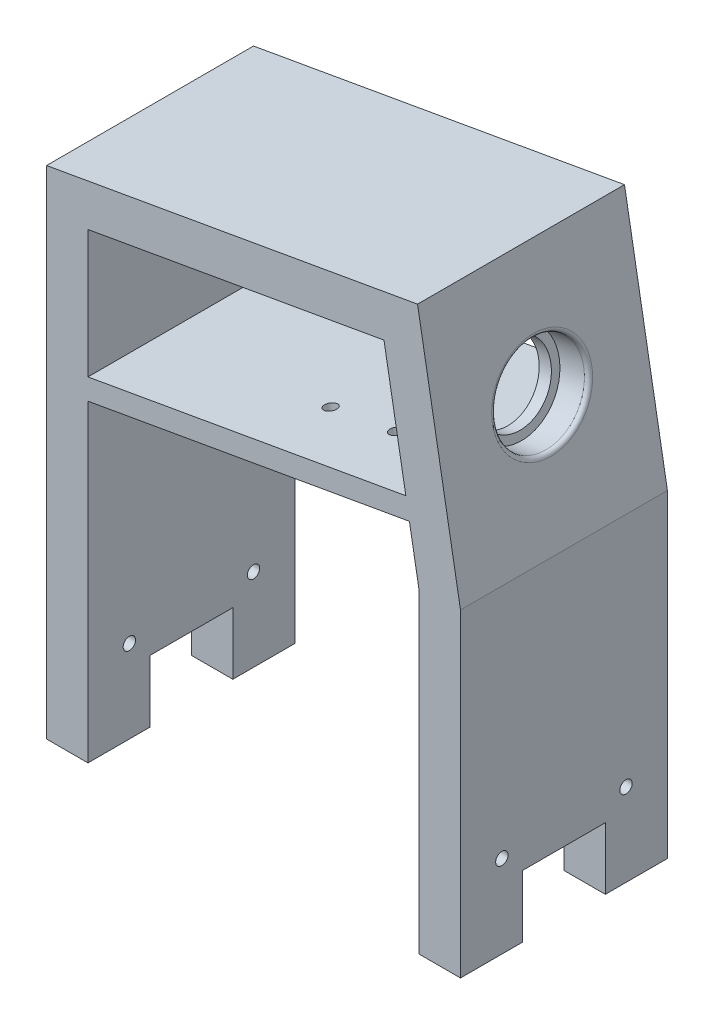
ISO-10303-21;
HEADER;
FILE_DESCRIPTION(('STEP AP214'),'2;1');
FILE_NAME('part.step','',(''),(''),'','','');
FILE_SCHEMA(('AUTOMOTIVE_DESIGN { 1 0 10303 214 1 1 1 1 }'));
ENDSEC;
DATA;
#1=APPLICATION_CONTEXT('core data for automotive mechanical design processes');
#2=APPLICATION_PROTOCOL_DEFINITION('international standard','automotive_design',2000,#1);
#3=PRODUCT_CONTEXT('',#1,'mechanical');
#4=PRODUCT('Part','Part','',(#3));
#5=PRODUCT_RELATED_PRODUCT_CATEGORY('part','',(#4));
#6=PRODUCT_DEFINITION_FORMATION('','',#4);
#7=PRODUCT_DEFINITION_CONTEXT('part definition',#1,'design');
#8=PRODUCT_DEFINITION('design','',#6,#7);
#9=PRODUCT_DEFINITION_SHAPE('','',#8);
#10=(LENGTH_UNIT() NAMED_UNIT(*) SI_UNIT(.MILLI.,.METRE.));
#11=(NAMED_UNIT(*) PLANE_ANGLE_UNIT() SI_UNIT($,.RADIAN.));
#12=(NAMED_UNIT(*) SI_UNIT($,.STERADIAN.) SOLID_ANGLE_UNIT());
#13=UNCERTAINTY_MEASURE_WITH_UNIT(LENGTH_MEASURE(1.E-05),#10,'distance_accuracy_value','');
#14=(GEOMETRIC_REPRESENTATION_CONTEXT(3) GLOBAL_UNCERTAINTY_ASSIGNED_CONTEXT((#13)) GLOBAL_UNIT_ASSIGNED_CONTEXT((#10,
#11,#12)) REPRESENTATION_CONTEXT('',''));
#15=CARTESIAN_POINT('',(0.,0.,0.));
#16=DIRECTION('',(0.,0.,1.));
#17=DIRECTION('',(1.,0.,0.));
#18=AXIS2_PLACEMENT_3D('',#15,#16,#17);
#19=CARTESIAN_POINT('',(50.0100000000001,105.,35.));
#20=DIRECTION('',(0.,-1.,0.));
#21=DIRECTION('',(1.,0.,0.));
#22=AXIS2_PLACEMENT_3D('',#19,#20,#21);
#23=PLANE('',#22);
#24=DIRECTION('',(0.,0.,-1.));
#25=VECTOR('',#24,1.);
#26=CARTESIAN_POINT('',(-40.,105.,50.));
#27=LINE('',#26,#25);
#28=CARTESIAN_POINT('',(-40.,105.,50.));
#29=VERTEX_POINT('',#28);
#30=CARTESIAN_POINT('',(-40.,105.,35.));
#31=VERTEX_POINT('',#30);
#32=EDGE_CURVE('E380',#29,#31,#27,.T.);
#33=ORIENTED_EDGE('',*,*,#32,.F.);
#34=DIRECTION('',(1.,0.,0.));
#35=VECTOR('',#34,1.);
#36=CARTESIAN_POINT('',(0.,105.,50.));
#37=LINE('',#36,#35);
#38=CARTESIAN_POINT('',(-50.,105.,50.));
#39=VERTEX_POINT('',#38);
#40=EDGE_CURVE('E366',#39,#29,#37,.T.);
#41=ORIENTED_EDGE('',*,*,#40,.F.);
#42=DIRECTION('',(0.,0.,-1.));
#43=VECTOR('',#42,1.);
#44=CARTESIAN_POINT('',(-50.,105.,50.));
#45=LINE('',#44,#43);
#46=CARTESIAN_POINT('',(-50.,105.,35.));
#47=VERTEX_POINT('',#46);
#48=EDGE_CURVE('E222',#39,#47,#45,.T.);
#49=ORIENTED_EDGE('',*,*,#48,.T.);
#50=DIRECTION('',(-1.,0.,0.));
#51=VECTOR('',#50,1.);
#52=CARTESIAN_POINT('',(50.0100000000001,105.,35.));
#53=LINE('',#52,#51);
#54=EDGE_CURVE('E11',#31,#47,#53,.T.);
#55=ORIENTED_EDGE('',*,*,#54,.F.);
#56=EDGE_LOOP('',(#33,#41,#49,#55));
#57=FACE_BOUND('',#56,.T.);
#58=ADVANCED_FACE('F41',(#57),#23,.T.);
#59=CARTESIAN_POINT('',(50.0100000000001,120.,35.));
#60=DIRECTION('',(0.,0.,-1.));
#61=DIRECTION('',(-1.,0.,0.));
#62=AXIS2_PLACEMENT_3D('',#59,#60,#61);
#63=PLANE('',#62);
#64=DIRECTION('',(0.,1.,0.));
#65=VECTOR('',#64,1.);
#66=CARTESIAN_POINT('',(-40.,216.619003688227,35.));
#67=LINE('',#66,#65);
#68=CARTESIAN_POINT('',(-40.,120.,35.));
#69=VERTEX_POINT('',#68);
#70=EDGE_CURVE('E383',#31,#69,#67,.T.);
#71=ORIENTED_EDGE('',*,*,#70,.F.);
#72=ORIENTED_EDGE('',*,*,#54,.T.);
#73=DIRECTION('',(0.,1.,0.));
#74=VECTOR('',#73,1.);
#75=CARTESIAN_POINT('',(-50.,225.01,35.));
#76=LINE('',#75,#74);
#77=CARTESIAN_POINT('',(-50.,120.,35.));
#78=VERTEX_POINT('',#77);
#79=EDGE_CURVE('E225',#47,#78,#76,.T.);
#80=ORIENTED_EDGE('',*,*,#79,.T.);
#81=DIRECTION('',(-1.,0.,0.));
#82=VECTOR('',#81,1.);
#83=CARTESIAN_POINT('',(50.0100000000001,120.,35.));
#84=LINE('',#83,#82);
#85=EDGE_CURVE('E354',#69,#78,#84,.T.);
#86=ORIENTED_EDGE('',*,*,#85,.F.);
#87=EDGE_LOOP('',(#71,#72,#80,#86));
#88=FACE_BOUND('',#87,.T.);
#89=ADVANCED_FACE('F407',(#88),#63,.T.);
#90=CARTESIAN_POINT('',(50.0100000000001,120.,15.));
#91=DIRECTION('',(0.,-1.,0.));
#92=DIRECTION('',(1.,0.,0.));
#93=AXIS2_PLACEMENT_3D('',#90,#91,#92);
#94=PLANE('',#93);
#95=DIRECTION('',(0.,0.,-1.));
#96=VECTOR('',#95,1.);
#97=CARTESIAN_POINT('',(-40.,120.,50.));
#98=LINE('',#97,#96);
#99=CARTESIAN_POINT('',(-40.,120.,15.));
#100=VERTEX_POINT('',#99);
#101=EDGE_CURVE('E386',#69,#100,#98,.T.);
#102=ORIENTED_EDGE('',*,*,#101,.F.);
#103=ORIENTED_EDGE('',*,*,#85,.T.);
#104=DIRECTION('',(0.,0.,-1.));
#105=VECTOR('',#104,1.);
#106=CARTESIAN_POINT('',(-50.,120.,50.));
#107=LINE('',#106,#105);
#108=CARTESIAN_POINT('',(-50.,120.,15.));
#109=VERTEX_POINT('',#108);
#110=EDGE_CURVE('E400',#78,#109,#107,.T.);
#111=ORIENTED_EDGE('',*,*,#110,.T.);
#112=DIRECTION('',(-1.,0.,0.));
#113=VECTOR('',#112,1.);
#114=CARTESIAN_POINT('',(50.0100000000001,120.,15.));
#115=LINE('',#114,#113);
#116=EDGE_CURVE('E357',#100,#109,#115,.T.);
#117=ORIENTED_EDGE('',*,*,#116,.F.);
#118=EDGE_LOOP('',(#102,#103,#111,#117));
#119=FACE_BOUND('',#118,.T.);
#120=ADVANCED_FACE('F414',(#119),#94,.T.);
#121=CARTESIAN_POINT('',(50.0100000000001,105.,15.));
#122=DIRECTION('',(0.,0.,1.));
#123=DIRECTION('',(1.,0.,0.));
#124=AXIS2_PLACEMENT_3D('',#121,#122,#123);
#125=PLANE('',#124);
#126=DIRECTION('',(0.,-1.,0.));
#127=VECTOR('',#126,1.);
#128=CARTESIAN_POINT('',(-40.,216.619003688227,15.));
#129=LINE('',#128,#127);
#130=CARTESIAN_POINT('',(-40.,105.,15.));
#131=VERTEX_POINT('',#130);
#132=EDGE_CURVE('E389',#100,#131,#129,.T.);
#133=ORIENTED_EDGE('',*,*,#132,.F.);
#134=ORIENTED_EDGE('',*,*,#116,.T.);
#135=DIRECTION('',(0.,-1.,0.));
#136=VECTOR('',#135,1.);
#137=CARTESIAN_POINT('',(-50.,225.01,15.));
#138=LINE('',#137,#136);
#139=CARTESIAN_POINT('',(-50.,105.,15.));
#140=VERTEX_POINT('',#139);
#141=EDGE_CURVE('E397',#109,#140,#138,.T.);
#142=ORIENTED_EDGE('',*,*,#141,.T.);
#143=DIRECTION('',(-1.,0.,0.));
#144=VECTOR('',#143,1.);
#145=CARTESIAN_POINT('',(50.0100000000001,105.,15.));
#146=LINE('',#145,#144);
#147=EDGE_CURVE('E360',#131,#140,#146,.T.);
#148=ORIENTED_EDGE('',*,*,#147,.F.);
#149=EDGE_LOOP('',(#133,#134,#142,#148));
#150=FACE_BOUND('',#149,.T.);
#151=ADVANCED_FACE('F420',(#150),#125,.T.);
#152=CARTESIAN_POINT('',(50.0100000000001,105.,0.));
#153=DIRECTION('',(0.,-1.,0.));
#154=DIRECTION('',(1.,0.,0.));
#155=AXIS2_PLACEMENT_3D('',#152,#153,#154);
#156=PLANE('',#155);
#157=DIRECTION('',(0.,0.,-1.));
#158=VECTOR('',#157,1.);
#159=CARTESIAN_POINT('',(-40.,105.,50.));
#160=LINE('',#159,#158);
#161=CARTESIAN_POINT('',(-40.,105.,0.));
#162=VERTEX_POINT('',#161);
#163=EDGE_CURVE('E392',#131,#162,#160,.T.);
#164=ORIENTED_EDGE('',*,*,#163,.F.);
#165=ORIENTED_EDGE('',*,*,#147,.T.);
#166=DIRECTION('',(0.,0.,-1.));
#167=VECTOR('',#166,1.);
#168=CARTESIAN_POINT('',(-50.,105.,50.));
#169=LINE('',#168,#167);
#170=CARTESIAN_POINT('',(-50.,105.,0.));
#171=VERTEX_POINT('',#170);
#172=EDGE_CURVE('E215',#140,#171,#169,.T.);
#173=ORIENTED_EDGE('',*,*,#172,.T.);
#174=DIRECTION('',(1.,0.,0.));
#175=VECTOR('',#174,1.);
#176=CARTESIAN_POINT('',(0.,105.,0.));
#177=LINE('',#176,#175);
#178=EDGE_CURVE('E214',#171,#162,#177,.T.);
#179=ORIENTED_EDGE('',*,*,#178,.T.);
#180=EDGE_LOOP('',(#164,#165,#173,#179));
#181=FACE_BOUND('',#180,.T.);
#182=ADVANCED_FACE('F422',(#181),#156,.T.);
#183=DIRECTION('',(0.,0.,1.));
#184=VECTOR('',#183,1.);
#185=CARTESIAN_POINT('',(40.,105.,50.));
#186=LINE('',#185,#184);
#187=CARTESIAN_POINT('',(40.,105.,35.));
#188=VERTEX_POINT('',#187);
#189=CARTESIAN_POINT('',(40.,105.,50.));
#190=VERTEX_POINT('',#189);
#191=EDGE_CURVE('E367',#188,#190,#186,.T.);
#192=ORIENTED_EDGE('',*,*,#191,.F.);
#193=CARTESIAN_POINT('',(50.,105.,35.));
#194=VERTEX_POINT('',#193);
#195=EDGE_CURVE('E50',#194,#188,#53,.T.);
#196=ORIENTED_EDGE('',*,*,#195,.F.);
#197=DIRECTION('',(0.,0.,1.));
#198=VECTOR('',#197,1.);
#199=CARTESIAN_POINT('',(50.,105.,50.));
#200=LINE('',#199,#198);
#201=CARTESIAN_POINT('',(50.,105.,50.));
#202=VERTEX_POINT('',#201);
#203=EDGE_CURVE('E236',#194,#202,#200,.T.);
#204=ORIENTED_EDGE('',*,*,#203,.T.);
#205=EDGE_CURVE('E362',#190,#202,#37,.T.);
#206=ORIENTED_EDGE('',*,*,#205,.F.);
#207=EDGE_LOOP('',(#192,#196,#204,#206));
#208=FACE_BOUND('',#207,.T.);
#209=ADVANCED_FACE('F442',(#208),#23,.T.);
#210=DIRECTION('',(0.,-1.,0.));
#211=VECTOR('',#210,1.);
#212=CARTESIAN_POINT('',(40.,10.,35.));
#213=LINE('',#212,#211);
#214=CARTESIAN_POINT('',(40.,120.,35.));
#215=VERTEX_POINT('',#214);
#216=EDGE_CURVE('E370',#215,#188,#213,.T.);
#217=ORIENTED_EDGE('',*,*,#216,.F.);
#218=CARTESIAN_POINT('',(50.,120.,35.));
#219=VERTEX_POINT('',#218);
#220=EDGE_CURVE('E356',#219,#215,#84,.T.);
#221=ORIENTED_EDGE('',*,*,#220,.F.);
#222=DIRECTION('',(0.,-1.,0.));
#223=VECTOR('',#222,1.);
#224=CARTESIAN_POINT('',(50.,0.,35.));
#225=LINE('',#224,#223);
#226=EDGE_CURVE('E233',#219,#194,#225,.T.);
#227=ORIENTED_EDGE('',*,*,#226,.T.);
#228=ORIENTED_EDGE('',*,*,#195,.T.);
#229=EDGE_LOOP('',(#217,#221,#227,#228));
#230=FACE_BOUND('',#229,.T.);
#231=ADVANCED_FACE('F446',(#230),#63,.T.);
#232=DIRECTION('',(0.,0.,1.));
#233=VECTOR('',#232,1.);
#234=CARTESIAN_POINT('',(40.,120.,50.));
#235=LINE('',#234,#233);
#236=CARTESIAN_POINT('',(40.,120.,15.));
#237=VERTEX_POINT('',#236);
#238=EDGE_CURVE('E373',#237,#215,#235,.T.);
#239=ORIENTED_EDGE('',*,*,#238,.F.);
#240=CARTESIAN_POINT('',(50.,120.,15.));
#241=VERTEX_POINT('',#240);
#242=EDGE_CURVE('E359',#241,#237,#115,.T.);
#243=ORIENTED_EDGE('',*,*,#242,.F.);
#244=DIRECTION('',(0.,0.,1.));
#245=VECTOR('',#244,1.);
#246=CARTESIAN_POINT('',(50.,120.,50.));
#247=LINE('',#246,#245);
#248=EDGE_CURVE('E227',#241,#219,#247,.T.);
#249=ORIENTED_EDGE('',*,*,#248,.T.);
#250=ORIENTED_EDGE('',*,*,#220,.T.);
#251=EDGE_LOOP('',(#239,#243,#249,#250));
#252=FACE_BOUND('',#251,.T.);
#253=ADVANCED_FACE('F449',(#252),#94,.T.);
#254=DIRECTION('',(0.,1.,0.));
#255=VECTOR('',#254,1.);
#256=CARTESIAN_POINT('',(40.,10.,15.));
#257=LINE('',#256,#255);
#258=CARTESIAN_POINT('',(40.,105.,15.));
#259=VERTEX_POINT('',#258);
#260=EDGE_CURVE('E376',#259,#237,#257,.T.);
#261=ORIENTED_EDGE('',*,*,#260,.F.);
#262=CARTESIAN_POINT('',(50.,105.,15.));
#263=VERTEX_POINT('',#262);
#264=EDGE_CURVE('E351',#263,#259,#146,.T.);
#265=ORIENTED_EDGE('',*,*,#264,.F.);
#266=DIRECTION('',(0.,1.,0.));
#267=VECTOR('',#266,1.);
#268=CARTESIAN_POINT('',(50.,0.,15.));
#269=LINE('',#268,#267);
#270=EDGE_CURVE('E221',#263,#241,#269,.T.);
#271=ORIENTED_EDGE('',*,*,#270,.T.);
#272=ORIENTED_EDGE('',*,*,#242,.T.);
#273=EDGE_LOOP('',(#261,#265,#271,#272));
#274=FACE_BOUND('',#273,.T.);
#275=ADVANCED_FACE('F452',(#274),#125,.T.);
#276=DIRECTION('',(0.,0.,1.));
#277=VECTOR('',#276,1.);
#278=CARTESIAN_POINT('',(40.,105.,50.));
#279=LINE('',#278,#277);
#280=CARTESIAN_POINT('',(40.,105.,0.));
#281=VERTEX_POINT('',#280);
#282=EDGE_CURVE('E213',#281,#259,#279,.T.);
#283=ORIENTED_EDGE('',*,*,#282,.F.);
#284=CARTESIAN_POINT('',(50.,105.,0.));
#285=VERTEX_POINT('',#284);
#286=EDGE_CURVE('E197',#281,#285,#177,.T.);
#287=ORIENTED_EDGE('',*,*,#286,.T.);
#288=DIRECTION('',(0.,0.,1.));
#289=VECTOR('',#288,1.);
#290=CARTESIAN_POINT('',(50.,105.,50.));
#291=LINE('',#290,#289);
#292=EDGE_CURVE('E211',#285,#263,#291,.T.);
#293=ORIENTED_EDGE('',*,*,#292,.T.);
#294=ORIENTED_EDGE('',*,*,#264,.T.);
#295=EDGE_LOOP('',(#283,#287,#293,#294));
#296=FACE_BOUND('',#295,.T.);
#297=ADVANCED_FACE('F210',(#296),#156,.T.);
#298=CARTESIAN_POINT('',(-40.,216.619003688227,50.));
#299=DIRECTION('',(1.,0.,0.));
#300=DIRECTION('',(0.,1.,0.));
#301=AXIS2_PLACEMENT_3D('',#298,#299,#300);
#302=PLANE('',#301);
#303=CARTESIAN_POINT('',(-40.,125.,40.));
#304=DIRECTION('',(1.,0.,0.));
#305=DIRECTION('',(0.,1.,0.));
#306=AXIS2_PLACEMENT_3D('',#303,#304,#305);
#307=CIRCLE('',#306,1.5);
#308=CARTESIAN_POINT('',(-40.,126.5,40.));
#309=VERTEX_POINT('',#308);
#310=EDGE_CURVE('E335',#309,#309,#307,.T.);
#311=ORIENTED_EDGE('',*,*,#310,.F.);
#312=EDGE_LOOP('',(#311));
#313=FACE_BOUND('',#312,.T.);
#314=CARTESIAN_POINT('',(-40.,125.,9.99999999999998));
#315=DIRECTION('',(1.,0.,0.));
#316=DIRECTION('',(0.,1.,0.));
#317=AXIS2_PLACEMENT_3D('',#314,#315,#316);
#318=CIRCLE('',#317,1.5);
#319=CARTESIAN_POINT('',(-40.,126.5,9.99999999999998));
#320=VERTEX_POINT('',#319);
#321=EDGE_CURVE('E319',#320,#320,#318,.T.);
#322=ORIENTED_EDGE('',*,*,#321,.F.);
#323=EDGE_LOOP('',(#322));
#324=FACE_BOUND('',#323,.T.);
#325=ORIENTED_EDGE('',*,*,#132,.T.);
#326=ORIENTED_EDGE('',*,*,#163,.T.);
#327=DIRECTION('',(0.,-1.,0.));
#328=VECTOR('',#327,1.);
#329=CARTESIAN_POINT('',(-40.,216.619003688227,0.));
#330=LINE('',#329,#328);
#331=CARTESIAN_POINT('',(-40.,180.69321015971,0.));
#332=VERTEX_POINT('',#331);
#333=EDGE_CURVE('E255',#332,#162,#330,.T.);
#334=ORIENTED_EDGE('',*,*,#333,.F.);
#335=DIRECTION('',(0.,0.,1.));
#336=VECTOR('',#335,1.);
#337=CARTESIAN_POINT('',(-40.,180.69321015971,0.));
#338=LINE('',#337,#336);
#339=CARTESIAN_POINT('',(-40.,180.69321015971,50.));
#340=VERTEX_POINT('',#339);
#341=EDGE_CURVE('E284',#332,#340,#338,.T.);
#342=ORIENTED_EDGE('',*,*,#341,.T.);
#343=DIRECTION('',(0.,-1.,0.));
#344=VECTOR('',#343,1.);
#345=CARTESIAN_POINT('',(-40.,216.619003688227,50.));
#346=LINE('',#345,#344);
#347=EDGE_CURVE('E58',#340,#29,#346,.T.);
#348=ORIENTED_EDGE('',*,*,#347,.T.);
#349=ORIENTED_EDGE('',*,*,#32,.T.);
#350=ORIENTED_EDGE('',*,*,#70,.T.);
#351=ORIENTED_EDGE('',*,*,#101,.T.);
#352=EDGE_LOOP('',(#325,#326,#334,#342,#348,#349,#350,#351));
#353=FACE_BOUND('',#352,.T.);
#354=ADVANCED_FACE('F417',(#313,#324,#353),#302,.T.);
#355=CARTESIAN_POINT('',(40.,10.,50.));
#356=DIRECTION('',(-1.,0.,0.));
#357=DIRECTION('',(0.,0.,1.));
#358=AXIS2_PLACEMENT_3D('',#355,#356,#357);
#359=PLANE('',#358);
#360=CARTESIAN_POINT('',(40.,125.,40.));
#361=DIRECTION('',(-1.,0.,0.));
#362=DIRECTION('',(0.,0.,1.));
#363=AXIS2_PLACEMENT_3D('',#360,#361,#362);
#364=CIRCLE('',#363,1.5);
#365=CARTESIAN_POINT('',(40.,125.,41.5));
#366=VERTEX_POINT('',#365);
#367=EDGE_CURVE('E338',#366,#366,#364,.T.);
#368=ORIENTED_EDGE('',*,*,#367,.F.);
#369=EDGE_LOOP('',(#368));
#370=FACE_BOUND('',#369,.T.);
#371=CARTESIAN_POINT('',(40.,125.,9.99999999999998));
#372=DIRECTION('',(-1.,0.,0.));
#373=DIRECTION('',(0.,0.,1.));
#374=AXIS2_PLACEMENT_3D('',#371,#372,#373);
#375=CIRCLE('',#374,1.5);
#376=CARTESIAN_POINT('',(40.,125.,11.5));
#377=VERTEX_POINT('',#376);
#378=EDGE_CURVE('E332',#377,#377,#375,.T.);
#379=ORIENTED_EDGE('',*,*,#378,.F.);
#380=EDGE_LOOP('',(#379));
#381=FACE_BOUND('',#380,.T.);
#382=DIRECTION('',(0.,1.,0.));
#383=VECTOR('',#382,1.);
#384=CARTESIAN_POINT('',(40.,10.,0.));
#385=LINE('',#384,#383);
#386=CARTESIAN_POINT('',(40.,181.135113364741,0.));
#387=VERTEX_POINT('',#386);
#388=EDGE_CURVE('E250',#281,#387,#385,.T.);
#389=ORIENTED_EDGE('',*,*,#388,.F.);
#390=ORIENTED_EDGE('',*,*,#282,.T.);
#391=ORIENTED_EDGE('',*,*,#260,.T.);
#392=ORIENTED_EDGE('',*,*,#238,.T.);
#393=ORIENTED_EDGE('',*,*,#216,.T.);
#394=ORIENTED_EDGE('',*,*,#191,.T.);
#395=DIRECTION('',(0.,1.,0.));
#396=VECTOR('',#395,1.);
#397=CARTESIAN_POINT('',(40.,10.,50.));
#398=LINE('',#397,#396);
#399=CARTESIAN_POINT('',(40.,181.135113364741,50.));
#400=VERTEX_POINT('',#399);
#401=EDGE_CURVE('E247',#190,#400,#398,.T.);
#402=ORIENTED_EDGE('',*,*,#401,.T.);
#403=DIRECTION('',(0.,0.,-1.));
#404=VECTOR('',#403,1.);
#405=CARTESIAN_POINT('',(40.,181.135113364741,50.));
#406=LINE('',#405,#404);
#407=EDGE_CURVE('E433',#400,#387,#406,.T.);
#408=ORIENTED_EDGE('',*,*,#407,.T.);
#409=EDGE_LOOP('',(#389,#390,#391,#392,#393,#394,#402,#408));
#410=FACE_BOUND('',#409,.T.);
#411=ADVANCED_FACE('F438',(#370,#381,#410),#359,.T.);
#412=CARTESIAN_POINT('',(0.,0.,50.));
#413=DIRECTION('',(0.,0.,1.));
#414=DIRECTION('',(1.,0.,0.));
#415=AXIS2_PLACEMENT_3D('',#412,#413,#414);
#416=PLANE('',#415);
#417=CARTESIAN_POINT('',(-40.,216.619003688227,50.));
#418=VERTEX_POINT('',#417);
#419=CARTESIAN_POINT('',(-40.,185.770343219138,50.));
#420=VERTEX_POINT('',#419);
#421=EDGE_CURVE('E249',#418,#420,#346,.T.);
#422=ORIENTED_EDGE('',*,*,#421,.F.);
#423=DIRECTION('',(-0.984807753012208,-0.173648177666932,0.));
#424=VECTOR('',#423,1.);
#425=CARTESIAN_POINT('',(31.5196022043407,229.229839206389,50.));
#426=LINE('',#425,#424);
#427=CARTESIAN_POINT('',(31.5196022043407,229.229839206389,50.));
#428=VERTEX_POINT('',#427);
#429=EDGE_CURVE('E262',#428,#418,#426,.T.);
#430=ORIENTED_EDGE('',*,*,#429,.F.);
#431=DIRECTION('',(-0.173648177666931,0.984807753012208,0.));
#432=VECTOR('',#431,1.);
#433=CARTESIAN_POINT('',(40.,181.135113364741,50.));
#434=LINE('',#433,#432);
#435=CARTESIAN_POINT('',(36.7950338418621,199.311379669878,50.));
#436=VERTEX_POINT('',#435);
#437=EDGE_CURVE('E66',#436,#428,#434,.T.);
#438=ORIENTED_EDGE('',*,*,#437,.F.);
#439=DIRECTION('',(-0.984807753012208,-0.173648177666932,0.));
#440=VECTOR('',#439,1.);
#441=CARTESIAN_POINT('',(36.7950338418621,199.311379669878,50.));
#442=LINE('',#441,#440);
#443=EDGE_CURVE('E292',#436,#420,#442,.T.);
#444=ORIENTED_EDGE('',*,*,#443,.T.);
#445=EDGE_LOOP('',(#422,#430,#438,#444));
#446=FACE_BOUND('',#445,.T.);
#447=DIRECTION('',(0.,-1.,0.));
#448=VECTOR('',#447,1.);
#449=CARTESIAN_POINT('',(-50.,225.01,50.));
#450=LINE('',#449,#448);
#451=CARTESIAN_POINT('',(-50.,225.01,50.));
#452=VERTEX_POINT('',#451);
#453=EDGE_CURVE('E241',#452,#39,#450,.T.);
#454=ORIENTED_EDGE('',*,*,#453,.T.);
#455=ORIENTED_EDGE('',*,*,#40,.T.);
#456=ORIENTED_EDGE('',*,*,#347,.F.);
#457=DIRECTION('',(0.984807753012208,0.173648177666932,0.));
#458=VECTOR('',#457,1.);
#459=CARTESIAN_POINT('',(-40.,180.69321015971,50.));
#460=LINE('',#459,#458);
#461=CARTESIAN_POINT('',(37.6632747301968,194.387340904817,50.));
#462=VERTEX_POINT('',#461);
#463=EDGE_CURVE('E290',#340,#462,#460,.T.);
#464=ORIENTED_EDGE('',*,*,#463,.T.);
#465=EDGE_CURVE('E270',#400,#462,#434,.T.);
#466=ORIENTED_EDGE('',*,*,#465,.F.);
#467=ORIENTED_EDGE('',*,*,#401,.F.);
#468=ORIENTED_EDGE('',*,*,#205,.T.);
#469=DIRECTION('',(0.,1.,0.));
#470=VECTOR('',#469,1.);
#471=CARTESIAN_POINT('',(50.,0.,50.));
#472=LINE('',#471,#470);
#473=CARTESIAN_POINT('',(50.,182.01,50.));
#474=VERTEX_POINT('',#473);
#475=EDGE_CURVE('E239',#202,#474,#472,.T.);
#476=ORIENTED_EDGE('',*,*,#475,.T.);
#477=DIRECTION('',(-0.173648177666931,0.984807753012208,0.));
#478=VECTOR('',#477,1.);
#479=CARTESIAN_POINT('',(50.,182.01,50.));
#480=LINE('',#479,#478);
#481=CARTESIAN_POINT('',(39.6311979577935,240.814398513181,50.));
#482=VERTEX_POINT('',#481);
#483=EDGE_CURVE('E205',#474,#482,#480,.T.);
#484=ORIENTED_EDGE('',*,*,#483,.T.);
#485=DIRECTION('',(-0.984807753012208,-0.173648177666932,0.));
#486=VECTOR('',#485,1.);
#487=CARTESIAN_POINT('',(39.6311979577935,240.814398513181,50.));
#488=LINE('',#487,#486);
#489=EDGE_CURVE('E243',#482,#452,#488,.T.);
#490=ORIENTED_EDGE('',*,*,#489,.T.);
#491=EDGE_LOOP('',(#454,#455,#456,#464,#466,#467,#468,#476,#484,#490));
#492=FACE_BOUND('',#491,.T.);
#493=ADVANCED_FACE('F435',(#446,#492),#416,.T.);
#494=CARTESIAN_POINT('',(0.,0.,0.));
#495=DIRECTION('',(0.,0.,1.));
#496=DIRECTION('',(1.,0.,0.));
#497=AXIS2_PLACEMENT_3D('',#494,#495,#496);
#498=PLANE('',#497);
#499=DIRECTION('',(-0.984807753012208,-0.173648177666932,0.));
#500=VECTOR('',#499,1.);
#501=CARTESIAN_POINT('',(31.5196022043407,229.229839206389,0.));
#502=LINE('',#501,#500);
#503=CARTESIAN_POINT('',(31.5196022043407,229.229839206389,0.));
#504=VERTEX_POINT('',#503);
#505=CARTESIAN_POINT('',(-40.,216.619003688227,0.));
#506=VERTEX_POINT('',#505);
#507=EDGE_CURVE('E267',#504,#506,#502,.T.);
#508=ORIENTED_EDGE('',*,*,#507,.T.);
#509=CARTESIAN_POINT('',(-40.,185.770343219138,0.));
#510=VERTEX_POINT('',#509);
#511=EDGE_CURVE('E45',#506,#510,#330,.T.);
#512=ORIENTED_EDGE('',*,*,#511,.T.);
#513=DIRECTION('',(-0.984807753012208,-0.173648177666932,0.));
#514=VECTOR('',#513,1.);
#515=CARTESIAN_POINT('',(36.7950338418621,199.311379669878,0.));
#516=LINE('',#515,#514);
#517=CARTESIAN_POINT('',(36.7950338418621,199.311379669878,0.));
#518=VERTEX_POINT('',#517);
#519=EDGE_CURVE('E293',#518,#510,#516,.T.);
#520=ORIENTED_EDGE('',*,*,#519,.F.);
#521=DIRECTION('',(-0.173648177666931,0.984807753012208,0.));
#522=VECTOR('',#521,1.);
#523=CARTESIAN_POINT('',(40.,181.135113364741,0.));
#524=LINE('',#523,#522);
#525=EDGE_CURVE('E251',#518,#504,#524,.T.);
#526=ORIENTED_EDGE('',*,*,#525,.T.);
#527=EDGE_LOOP('',(#508,#512,#520,#526));
#528=FACE_BOUND('',#527,.T.);
#529=ORIENTED_EDGE('',*,*,#178,.F.);
#530=DIRECTION('',(0.,-1.,0.));
#531=VECTOR('',#530,1.);
#532=CARTESIAN_POINT('',(-50.,225.01,0.));
#533=LINE('',#532,#531);
#534=CARTESIAN_POINT('',(-50.,225.01,0.));
#535=VERTEX_POINT('',#534);
#536=EDGE_CURVE('E204',#535,#171,#533,.T.);
#537=ORIENTED_EDGE('',*,*,#536,.F.);
#538=DIRECTION('',(-0.984807753012208,-0.173648177666932,0.));
#539=VECTOR('',#538,1.);
#540=CARTESIAN_POINT('',(39.6311979577935,240.814398513181,0.));
#541=LINE('',#540,#539);
#542=CARTESIAN_POINT('',(39.6311979577935,240.814398513181,0.));
#543=VERTEX_POINT('',#542);
#544=EDGE_CURVE('E246',#543,#535,#541,.T.);
#545=ORIENTED_EDGE('',*,*,#544,.F.);
#546=DIRECTION('',(-0.173648177666931,0.984807753012208,0.));
#547=VECTOR('',#546,1.);
#548=CARTESIAN_POINT('',(50.,182.01,0.));
#549=LINE('',#548,#547);
#550=CARTESIAN_POINT('',(50.,182.01,0.));
#551=VERTEX_POINT('',#550);
#552=EDGE_CURVE('E199',#551,#543,#549,.T.);
#553=ORIENTED_EDGE('',*,*,#552,.F.);
#554=DIRECTION('',(0.,1.,0.));
#555=VECTOR('',#554,1.);
#556=CARTESIAN_POINT('',(50.,0.,0.));
#557=LINE('',#556,#555);
#558=EDGE_CURVE('E193',#285,#551,#557,.T.);
#559=ORIENTED_EDGE('',*,*,#558,.F.);
#560=ORIENTED_EDGE('',*,*,#286,.F.);
#561=ORIENTED_EDGE('',*,*,#388,.T.);
#562=CARTESIAN_POINT('',(37.6632747301968,194.387340904817,0.));
#563=VERTEX_POINT('',#562);
#564=EDGE_CURVE('E256',#387,#563,#524,.T.);
#565=ORIENTED_EDGE('',*,*,#564,.T.);
#566=DIRECTION('',(0.984807753012208,0.173648177666932,0.));
#567=VECTOR('',#566,1.);
#568=CARTESIAN_POINT('',(-40.,180.69321015971,0.));
#569=LINE('',#568,#567);
#570=EDGE_CURVE('E283',#332,#563,#569,.T.);
#571=ORIENTED_EDGE('',*,*,#570,.F.);
#572=ORIENTED_EDGE('',*,*,#333,.T.);
#573=EDGE_LOOP('',(#529,#537,#545,#553,#559,#560,#561,#565,#571,#572));
#574=FACE_BOUND('',#573,.T.);
#575=ADVANCED_FACE('F196',(#528,#574),#498,.F.);
#576=CARTESIAN_POINT('',(-50.,225.01,50.));
#577=DIRECTION('',(1.,0.,0.));
#578=DIRECTION('',(0.,1.,0.));
#579=AXIS2_PLACEMENT_3D('',#576,#577,#578);
#580=PLANE('',#579);
#581=CARTESIAN_POINT('',(-50.,204.163858421681,25.));
#582=DIRECTION('',(-1.,0.,0.));
#583=DIRECTION('',(0.,-1.,0.));
#584=AXIS2_PLACEMENT_3D('',#581,#582,#583);
#585=CIRCLE('',#584,5.);
#586=CARTESIAN_POINT('',(-50.,199.163858421681,25.));
#587=VERTEX_POINT('',#586);
#588=EDGE_CURVE('E300',#587,#587,#585,.T.);
#589=ORIENTED_EDGE('',*,*,#588,.F.);
#590=EDGE_LOOP('',(#589));
#591=FACE_BOUND('',#590,.T.);
#592=CARTESIAN_POINT('',(-50.,125.,40.));
#593=DIRECTION('',(-1.,0.,0.));
#594=DIRECTION('',(0.,-1.,0.));
#595=AXIS2_PLACEMENT_3D('',#592,#593,#594);
#596=CIRCLE('',#595,1.5);
#597=CARTESIAN_POINT('',(-50.,123.5,40.));
#598=VERTEX_POINT('',#597);
#599=EDGE_CURVE('E342',#598,#598,#596,.T.);
#600=ORIENTED_EDGE('',*,*,#599,.F.);
#601=EDGE_LOOP('',(#600));
#602=FACE_BOUND('',#601,.T.);
#603=CARTESIAN_POINT('',(-50.,125.,9.99999999999998));
#604=DIRECTION('',(-1.,0.,0.));
#605=DIRECTION('',(0.,1.,0.));
#606=AXIS2_PLACEMENT_3D('',#603,#604,#605);
#607=CIRCLE('',#606,1.5);
#608=CARTESIAN_POINT('',(-50.,126.5,9.99999999999998));
#609=VERTEX_POINT('',#608);
#610=EDGE_CURVE('E345',#609,#609,#607,.T.);
#611=ORIENTED_EDGE('',*,*,#610,.F.);
#612=EDGE_LOOP('',(#611));
#613=FACE_BOUND('',#612,.T.);
#614=ORIENTED_EDGE('',*,*,#172,.F.);
#615=ORIENTED_EDGE('',*,*,#141,.F.);
#616=ORIENTED_EDGE('',*,*,#110,.F.);
#617=ORIENTED_EDGE('',*,*,#79,.F.);
#618=ORIENTED_EDGE('',*,*,#48,.F.);
#619=ORIENTED_EDGE('',*,*,#453,.F.);
#620=DIRECTION('',(0.,0.,-1.));
#621=VECTOR('',#620,1.);
#622=CARTESIAN_POINT('',(-50.,225.01,50.));
#623=LINE('',#622,#621);
#624=EDGE_CURVE('E509',#452,#535,#623,.T.);
#625=ORIENTED_EDGE('',*,*,#624,.T.);
#626=ORIENTED_EDGE('',*,*,#536,.T.);
#627=EDGE_LOOP('',(#614,#615,#616,#617,#618,#619,#625,#626));
#628=FACE_BOUND('',#627,.T.);
#629=ADVANCED_FACE('F43',(#591,#602,#613,#628),#580,.F.);
#630=CARTESIAN_POINT('',(50.,0.,50.));
#631=DIRECTION('',(-1.,0.,0.));
#632=DIRECTION('',(0.,-1.,0.));
#633=AXIS2_PLACEMENT_3D('',#630,#631,#632);
#634=PLANE('',#633);
#635=CARTESIAN_POINT('',(50.,125.,40.));
#636=DIRECTION('',(-1.,0.,0.));
#637=DIRECTION('',(0.,-1.,0.));
#638=AXIS2_PLACEMENT_3D('',#635,#636,#637);
#639=CIRCLE('',#638,1.5);
#640=CARTESIAN_POINT('',(50.,123.5,40.));
#641=VERTEX_POINT('',#640);
#642=EDGE_CURVE('E341',#641,#641,#639,.T.);
#643=ORIENTED_EDGE('',*,*,#642,.T.);
#644=EDGE_LOOP('',(#643));
#645=FACE_BOUND('',#644,.T.);
#646=CARTESIAN_POINT('',(50.,125.,9.99999999999998));
#647=DIRECTION('',(-1.,0.,0.));
#648=DIRECTION('',(0.,1.,0.));
#649=AXIS2_PLACEMENT_3D('',#646,#647,#648);
#650=CIRCLE('',#649,1.5);
#651=CARTESIAN_POINT('',(50.,126.5,9.99999999999998));
#652=VERTEX_POINT('',#651);
#653=EDGE_CURVE('E348',#652,#652,#650,.T.);
#654=ORIENTED_EDGE('',*,*,#653,.T.);
#655=EDGE_LOOP('',(#654));
#656=FACE_BOUND('',#655,.T.);
#657=ORIENTED_EDGE('',*,*,#292,.F.);
#658=ORIENTED_EDGE('',*,*,#558,.T.);
#659=DIRECTION('',(0.,0.,-1.));
#660=VECTOR('',#659,1.);
#661=CARTESIAN_POINT('',(50.,182.01,50.));
#662=LINE('',#661,#660);
#663=EDGE_CURVE('E242',#474,#551,#662,.T.);
#664=ORIENTED_EDGE('',*,*,#663,.F.);
#665=ORIENTED_EDGE('',*,*,#475,.F.);
#666=ORIENTED_EDGE('',*,*,#203,.F.);
#667=ORIENTED_EDGE('',*,*,#226,.F.);
#668=ORIENTED_EDGE('',*,*,#248,.F.);
#669=ORIENTED_EDGE('',*,*,#270,.F.);
#670=EDGE_LOOP('',(#657,#658,#664,#665,#666,#667,#668,#669));
#671=FACE_BOUND('',#670,.T.);
#672=ADVANCED_FACE('F218',(#645,#656,#671),#634,.F.);
#673=CARTESIAN_POINT('',(43.7486946091687,211.704144128756,25.));
#674=DIRECTION('',(-0.984807753012208,-0.173648177666931,0.));
#675=DIRECTION('',(0.173648177666931,-0.984807753012208,0.));
#676=AXIS2_PLACEMENT_3D('',#673,#674,#675);
#677=TOROIDAL_SURFACE('',#676,12.025,1.);
#678=CARTESIAN_POINT('',(43.7486946091687,211.704144128756,25.));
#679=DIRECTION('',(-0.984807753012208,-0.173648177666931,0.));
#680=DIRECTION('',(0.173648177666931,-0.984807753012208,0.));
#681=AXIS2_PLACEMENT_3D('',#678,#679,#680);
#682=CIRCLE('',#681,11.025);
#683=CARTESIAN_POINT('',(45.6631657679466,200.846638651796,25.));
#684=VERTEX_POINT('',#683);
#685=EDGE_CURVE('E515',#684,#684,#682,.F.);
#686=ORIENTED_EDGE('',*,*,#685,.F.);
#687=EDGE_LOOP('',(#686));
#688=FACE_BOUND('',#687,.T.);
#689=CARTESIAN_POINT('',(44.7335023621809,211.877792306423,25.));
#690=DIRECTION('',(-0.984807753012208,-0.173648177666931,0.));
#691=DIRECTION('',(0.173648177666931,-0.984807753012208,0.));
#692=AXIS2_PLACEMENT_3D('',#689,#690,#691);
#693=CIRCLE('',#692,12.025);
#694=CARTESIAN_POINT('',(46.8216216986258,200.035479076451,25.));
#695=VERTEX_POINT('',#694);
#696=EDGE_CURVE('E365',#695,#695,#693,.T.);
#697=ORIENTED_EDGE('',*,*,#696,.F.);
#698=EDGE_LOOP('',(#697));
#699=FACE_BOUND('',#698,.T.);
#700=ADVANCED_FACE('F476',(#688,#699),#677,.T.);
#701=CARTESIAN_POINT('',(-40.,204.163858421681,25.));
#702=DIRECTION('',(-1.,0.,0.));
#703=DIRECTION('',(0.,-1.,0.));
#704=AXIS2_PLACEMENT_3D('',#701,#702,#703);
#705=CIRCLE('',#704,5.);
#706=CARTESIAN_POINT('',(-40.,199.163858421681,25.));
#707=VERTEX_POINT('',#706);
#708=EDGE_CURVE('E295',#707,#707,#705,.T.);
#709=ORIENTED_EDGE('',*,*,#708,.T.);
#710=EDGE_LOOP('',(#709));
#711=FACE_BOUND('',#710,.T.);
#712=DIRECTION('',(0.,0.,1.));
#713=VECTOR('',#712,1.);
#714=CARTESIAN_POINT('',(-40.,185.770343219138,0.));
#715=LINE('',#714,#713);
#716=EDGE_CURVE('E280',#510,#420,#715,.T.);
#717=ORIENTED_EDGE('',*,*,#716,.F.);
#718=ORIENTED_EDGE('',*,*,#511,.F.);
#719=DIRECTION('',(0.,0.,-1.));
#720=VECTOR('',#719,1.);
#721=CARTESIAN_POINT('',(-40.,216.619003688227,50.));
#722=LINE('',#721,#720);
#723=EDGE_CURVE('E500',#418,#506,#722,.T.);
#724=ORIENTED_EDGE('',*,*,#723,.F.);
#725=ORIENTED_EDGE('',*,*,#421,.T.);
#726=EDGE_LOOP('',(#717,#718,#724,#725));
#727=FACE_BOUND('',#726,.T.);
#728=ADVANCED_FACE('F465',(#711,#727),#302,.T.);
#729=CARTESIAN_POINT('',(40.,181.135113364741,50.));
#730=DIRECTION('',(-0.984807753012208,-0.173648177666931,0.));
#731=DIRECTION('',(0.173648177666931,-0.984807753012208,0.));
#732=AXIS2_PLACEMENT_3D('',#729,#730,#731);
#733=PLANE('',#732);
#734=DIRECTION('',(0.,0.,1.));
#735=VECTOR('',#734,1.);
#736=CARTESIAN_POINT('',(36.7950338418621,199.311379669878,0.));
#737=LINE('',#736,#735);
#738=EDGE_CURVE('E279',#518,#436,#737,.T.);
#739=ORIENTED_EDGE('',*,*,#738,.T.);
#740=ORIENTED_EDGE('',*,*,#437,.T.);
#741=DIRECTION('',(0.,0.,-1.));
#742=VECTOR('',#741,1.);
#743=CARTESIAN_POINT('',(31.5196022043407,229.229839206389,50.));
#744=LINE('',#743,#742);
#745=EDGE_CURVE('E265',#428,#504,#744,.T.);
#746=ORIENTED_EDGE('',*,*,#745,.T.);
#747=ORIENTED_EDGE('',*,*,#525,.F.);
#748=EDGE_LOOP('',(#739,#740,#746,#747));
#749=FACE_BOUND('',#748,.T.);
#750=CARTESIAN_POINT('',(34.8854248320589,210.141310529754,25.));
#751=DIRECTION('',(-0.984807753012208,-0.173648177666931,0.));
#752=DIRECTION('',(0.173648177666931,-0.984807753012208,0.));
#753=AXIS2_PLACEMENT_3D('',#750,#751,#752);
#754=CIRCLE('',#753,9.00000000000001);
#755=CARTESIAN_POINT('',(36.4482584310612,201.278040752644,25.));
#756=VERTEX_POINT('',#755);
#757=EDGE_CURVE('E275',#756,#756,#754,.T.);
#758=ORIENTED_EDGE('',*,*,#757,.F.);
#759=EDGE_LOOP('',(#758));
#760=FACE_BOUND('',#759,.T.);
#761=ADVANCED_FACE('F475',(#749,#760),#733,.T.);
#762=CARTESIAN_POINT('',(50.,182.01,50.));
#763=DIRECTION('',(-0.984807753012208,-0.173648177666931,0.));
#764=DIRECTION('',(0.173648177666931,-0.984807753012208,0.));
#765=AXIS2_PLACEMENT_3D('',#762,#763,#764);
#766=PLANE('',#765);
#767=ORIENTED_EDGE('',*,*,#696,.T.);
#768=EDGE_LOOP('',(#767));
#769=FACE_BOUND('',#768,.T.);
#770=ORIENTED_EDGE('',*,*,#552,.T.);
#771=DIRECTION('',(0.,0.,-1.));
#772=VECTOR('',#771,1.);
#773=CARTESIAN_POINT('',(39.6311979577935,240.814398513181,50.));
#774=LINE('',#773,#772);
#775=EDGE_CURVE('E512',#482,#543,#774,.T.);
#776=ORIENTED_EDGE('',*,*,#775,.F.);
#777=ORIENTED_EDGE('',*,*,#483,.F.);
#778=ORIENTED_EDGE('',*,*,#663,.T.);
#779=EDGE_LOOP('',(#770,#776,#777,#778));
#780=FACE_BOUND('',#779,.T.);
#781=ADVANCED_FACE('F482',(#769,#780),#766,.F.);
#782=CARTESIAN_POINT('',(39.6311979577935,240.814398513181,50.));
#783=DIRECTION('',(0.173648177666932,-0.984807753012208,0.));
#784=DIRECTION('',(0.984807753012208,0.173648177666932,0.));
#785=AXIS2_PLACEMENT_3D('',#782,#783,#784);
#786=PLANE('',#785);
#787=ORIENTED_EDGE('',*,*,#544,.T.);
#788=ORIENTED_EDGE('',*,*,#624,.F.);
#789=ORIENTED_EDGE('',*,*,#489,.F.);
#790=ORIENTED_EDGE('',*,*,#775,.T.);
#791=EDGE_LOOP('',(#787,#788,#789,#790));
#792=FACE_BOUND('',#791,.T.);
#793=ADVANCED_FACE('F526',(#792),#786,.F.);
#794=CARTESIAN_POINT('',(31.5196022043407,229.229839206389,50.));
#795=DIRECTION('',(0.173648177666932,-0.984807753012208,0.));
#796=DIRECTION('',(0.984807753012208,0.173648177666932,0.));
#797=AXIS2_PLACEMENT_3D('',#794,#795,#796);
#798=PLANE('',#797);
#799=ORIENTED_EDGE('',*,*,#507,.F.);
#800=ORIENTED_EDGE('',*,*,#745,.F.);
#801=ORIENTED_EDGE('',*,*,#429,.T.);
#802=ORIENTED_EDGE('',*,*,#723,.T.);
#803=EDGE_LOOP('',(#799,#800,#801,#802));
#804=FACE_BOUND('',#803,.T.);
#805=ADVANCED_FACE('F585',(#804),#798,.T.);
#806=DIRECTION('',(0.,0.,1.));
#807=VECTOR('',#806,1.);
#808=CARTESIAN_POINT('',(37.6632747301968,194.387340904817,0.));
#809=LINE('',#808,#807);
#810=EDGE_CURVE('E286',#563,#462,#809,.T.);
#811=ORIENTED_EDGE('',*,*,#810,.F.);
#812=ORIENTED_EDGE('',*,*,#564,.F.);
#813=ORIENTED_EDGE('',*,*,#407,.F.);
#814=ORIENTED_EDGE('',*,*,#465,.T.);
#815=EDGE_LOOP('',(#811,#812,#813,#814));
#816=FACE_BOUND('',#815,.T.);
#817=ADVANCED_FACE('F432',(#816),#733,.T.);
#818=CARTESIAN_POINT('',(37.8398480910955,210.662255062754,25.));
#819=DIRECTION('',(0.984807753012208,0.173648177666931,0.));
#820=DIRECTION('',(-0.173648177666931,0.984807753012208,0.));
#821=AXIS2_PLACEMENT_3D('',#818,#819,#820);
#822=CYLINDRICAL_SURFACE('',#821,11.025);
#823=ORIENTED_EDGE('',*,*,#685,.T.);
#824=EDGE_LOOP('',(#823));
#825=FACE_BOUND('',#824,.T.);
#826=CARTESIAN_POINT('',(37.8398480910955,210.662255062754,25.));
#827=DIRECTION('',(0.984807753012208,0.173648177666931,0.));
#828=DIRECTION('',(-0.173648177666931,0.984807753012208,0.));
#829=AXIS2_PLACEMENT_3D('',#826,#827,#828);
#830=CIRCLE('',#829,11.025);
#831=CARTESIAN_POINT('',(35.9253769323176,221.519760539714,25.));
#832=VERTEX_POINT('',#831);
#833=EDGE_CURVE('E269',#832,#832,#830,.T.);
#834=ORIENTED_EDGE('',*,*,#833,.F.);
#835=EDGE_LOOP('',(#834));
#836=FACE_BOUND('',#835,.T.);
#837=ADVANCED_FACE('F592',(#825,#836),#822,.F.);
#838=CARTESIAN_POINT('',(37.8398480910955,210.662255062754,25.));
#839=DIRECTION('',(0.984807753012208,0.173648177666931,0.));
#840=DIRECTION('',(-0.173648177666931,0.984807753012208,0.));
#841=AXIS2_PLACEMENT_3D('',#838,#839,#840);
#842=PLANE('',#841);
#843=CARTESIAN_POINT('',(37.8398480910955,210.662255062754,25.));
#844=DIRECTION('',(0.984807753012208,0.173648177666931,0.));
#845=DIRECTION('',(-0.173648177666931,0.984807753012208,0.));
#846=AXIS2_PLACEMENT_3D('',#843,#844,#845);
#847=CIRCLE('',#846,9.00000000000001);
#848=CARTESIAN_POINT('',(36.2770144920931,219.525524839864,25.));
#849=VERTEX_POINT('',#848);
#850=EDGE_CURVE('E276',#849,#849,#847,.T.);
#851=ORIENTED_EDGE('',*,*,#850,.F.);
#852=EDGE_LOOP('',(#851));
#853=FACE_BOUND('',#852,.T.);
#854=ORIENTED_EDGE('',*,*,#833,.T.);
#855=EDGE_LOOP('',(#854));
#856=FACE_BOUND('',#855,.T.);
#857=ADVANCED_FACE('F597',(#853,#856),#842,.T.);
#858=CARTESIAN_POINT('',(30.94619382001,209.446717819086,25.));
#859=DIRECTION('',(0.984807753012208,0.173648177666931,0.));
#860=DIRECTION('',(-0.173648177666931,0.984807753012208,0.));
#861=AXIS2_PLACEMENT_3D('',#858,#859,#860);
#862=CYLINDRICAL_SURFACE('',#861,9.00000000000001);
#863=ORIENTED_EDGE('',*,*,#757,.T.);
#864=EDGE_LOOP('',(#863));
#865=FACE_BOUND('',#864,.T.);
#866=ORIENTED_EDGE('',*,*,#850,.T.);
#867=EDGE_LOOP('',(#866));
#868=FACE_BOUND('',#867,.T.);
#869=ADVANCED_FACE('F601',(#865,#868),#862,.F.);
#870=CARTESIAN_POINT('',(36.7950338418621,199.311379669878,0.));
#871=DIRECTION('',(-0.173648177666932,0.984807753012208,0.));
#872=DIRECTION('',(-0.984807753012208,-0.173648177666932,0.));
#873=AXIS2_PLACEMENT_3D('',#870,#871,#872);
#874=PLANE('',#873);
#875=CARTESIAN_POINT('',(3.23427983735533,193.393713245964,15.4));
#876=DIRECTION('',(-0.173648177666932,0.984807753012208,0.));
#877=DIRECTION('',(-0.984807753012208,-0.173648177666932,0.));
#878=AXIS2_PLACEMENT_3D('',#875,#876,#877);
#879=CIRCLE('',#878,1.48499999999999);
#880=CARTESIAN_POINT('',(1.77184032413221,193.135845702129,15.4));
#881=VERTEX_POINT('',#880);
#882=EDGE_CURVE('E315',#881,#881,#879,.T.);
#883=ORIENTED_EDGE('',*,*,#882,.F.);
#884=EDGE_LOOP('',(#883));
#885=FACE_BOUND('',#884,.T.);
#886=CARTESIAN_POINT('',(3.23427983735533,193.393713245964,34.6));
#887=DIRECTION('',(-0.173648177666932,0.984807753012208,0.));
#888=DIRECTION('',(-0.984807753012208,-0.173648177666932,0.));
#889=AXIS2_PLACEMENT_3D('',#886,#887,#888);
#890=CIRCLE('',#889,1.48500000000001);
#891=CARTESIAN_POINT('',(1.77184032413219,193.135845702129,34.6));
#892=VERTEX_POINT('',#891);
#893=EDGE_CURVE('E316',#892,#892,#890,.T.);
#894=ORIENTED_EDGE('',*,*,#893,.F.);
#895=EDGE_LOOP('',(#894));
#896=FACE_BOUND('',#895,.T.);
#897=CARTESIAN_POINT('',(18.9912038855507,196.172084088635,34.6));
#898=DIRECTION('',(-0.173648177666932,0.984807753012208,0.));
#899=DIRECTION('',(-0.984807753012208,-0.173648177666932,0.));
#900=AXIS2_PLACEMENT_3D('',#897,#898,#899);
#901=CIRCLE('',#900,1.48500000000002);
#902=CARTESIAN_POINT('',(17.5287643723275,195.9142165448,34.6));
#903=VERTEX_POINT('',#902);
#904=EDGE_CURVE('E323',#903,#903,#901,.T.);
#905=ORIENTED_EDGE('',*,*,#904,.F.);
#906=EDGE_LOOP('',(#905));
#907=FACE_BOUND('',#906,.T.);
#908=CARTESIAN_POINT('',(18.9912038855507,196.172084088635,15.4));
#909=DIRECTION('',(-0.173648177666932,0.984807753012208,0.));
#910=DIRECTION('',(-0.984807753012208,-0.173648177666932,0.));
#911=AXIS2_PLACEMENT_3D('',#908,#909,#910);
#912=CIRCLE('',#911,1.485);
#913=CARTESIAN_POINT('',(17.5287643723275,195.9142165448,15.4));
#914=VERTEX_POINT('',#913);
#915=EDGE_CURVE('E308',#914,#914,#912,.T.);
#916=ORIENTED_EDGE('',*,*,#915,.F.);
#917=EDGE_LOOP('',(#916));
#918=FACE_BOUND('',#917,.T.);
#919=ORIENTED_EDGE('',*,*,#443,.F.);
#920=ORIENTED_EDGE('',*,*,#738,.F.);
#921=ORIENTED_EDGE('',*,*,#519,.T.);
#922=ORIENTED_EDGE('',*,*,#716,.T.);
#923=EDGE_LOOP('',(#919,#920,#921,#922));
#924=FACE_BOUND('',#923,.T.);
#925=ADVANCED_FACE('F495',(#885,#896,#907,#918,#924),#874,.T.);
#926=CARTESIAN_POINT('',(-40.,180.69321015971,0.));
#927=DIRECTION('',(0.173648177666932,-0.984807753012208,0.));
#928=DIRECTION('',(0.984807753012208,0.173648177666932,0.));
#929=AXIS2_PLACEMENT_3D('',#926,#927,#928);
#930=PLANE('',#929);
#931=CARTESIAN_POINT('',(4.10252072568998,188.469674480903,15.4));
#932=DIRECTION('',(-0.173648177666932,0.984807753012208,0.));
#933=DIRECTION('',(0.984807753012208,0.173648177666932,0.));
#934=AXIS2_PLACEMENT_3D('',#931,#932,#933);
#935=CIRCLE('',#934,1.48499999999999);
#936=CARTESIAN_POINT('',(5.5649602389131,188.727542024738,15.4));
#937=VERTEX_POINT('',#936);
#938=EDGE_CURVE('E312',#937,#937,#935,.T.);
#939=ORIENTED_EDGE('',*,*,#938,.T.);
#940=EDGE_LOOP('',(#939));
#941=FACE_BOUND('',#940,.T.);
#942=CARTESIAN_POINT('',(4.10252072568998,188.469674480903,34.6));
#943=DIRECTION('',(-0.173648177666932,0.984807753012208,0.));
#944=DIRECTION('',(0.984807753012208,0.173648177666932,0.));
#945=AXIS2_PLACEMENT_3D('',#942,#943,#944);
#946=CIRCLE('',#945,1.48500000000001);
#947=CARTESIAN_POINT('',(5.56496023891311,188.727542024738,34.6));
#948=VERTEX_POINT('',#947);
#949=EDGE_CURVE('E320',#948,#948,#946,.T.);
#950=ORIENTED_EDGE('',*,*,#949,.T.);
#951=EDGE_LOOP('',(#950));
#952=FACE_BOUND('',#951,.T.);
#953=CARTESIAN_POINT('',(19.8594447738853,191.248045323574,34.6));
#954=DIRECTION('',(-0.173648177666932,0.984807753012208,0.));
#955=DIRECTION('',(-0.984807753012208,-0.173648177666932,0.));
#956=AXIS2_PLACEMENT_3D('',#953,#954,#955);
#957=CIRCLE('',#956,1.48500000000002);
#958=CARTESIAN_POINT('',(18.3970052606622,190.990177779739,34.6));
#959=VERTEX_POINT('',#958);
#960=EDGE_CURVE('E311',#959,#959,#957,.T.);
#961=ORIENTED_EDGE('',*,*,#960,.T.);
#962=EDGE_LOOP('',(#961));
#963=FACE_BOUND('',#962,.T.);
#964=CARTESIAN_POINT('',(19.8594447738853,191.248045323574,15.4));
#965=DIRECTION('',(-0.173648177666932,0.984807753012208,0.));
#966=DIRECTION('',(-0.984807753012208,-0.173648177666932,0.));
#967=AXIS2_PLACEMENT_3D('',#964,#965,#966);
#968=CIRCLE('',#967,1.485);
#969=CARTESIAN_POINT('',(18.3970052606622,190.990177779739,15.4));
#970=VERTEX_POINT('',#969);
#971=EDGE_CURVE('E303',#970,#970,#968,.T.);
#972=ORIENTED_EDGE('',*,*,#971,.T.);
#973=EDGE_LOOP('',(#972));
#974=FACE_BOUND('',#973,.T.);
#975=ORIENTED_EDGE('',*,*,#463,.F.);
#976=ORIENTED_EDGE('',*,*,#341,.F.);
#977=ORIENTED_EDGE('',*,*,#570,.T.);
#978=ORIENTED_EDGE('',*,*,#810,.T.);
#979=EDGE_LOOP('',(#975,#976,#977,#978));
#980=FACE_BOUND('',#979,.T.);
#981=ADVANCED_FACE('F428',(#941,#952,#963,#974,#980),#930,.T.);
#982=CARTESIAN_POINT('',(-40.,204.163858421681,25.));
#983=DIRECTION('',(-1.,0.,0.));
#984=DIRECTION('',(0.,-1.,0.));
#985=AXIS2_PLACEMENT_3D('',#982,#983,#984);
#986=CYLINDRICAL_SURFACE('',#985,5.);
#987=ORIENTED_EDGE('',*,*,#708,.F.);
#988=EDGE_LOOP('',(#987));
#989=FACE_BOUND('',#988,.T.);
#990=ORIENTED_EDGE('',*,*,#588,.T.);
#991=EDGE_LOOP('',(#990));
#992=FACE_BOUND('',#991,.T.);
#993=ADVANCED_FACE('F611',(#989,#992),#986,.F.);
#994=CARTESIAN_POINT('',(9.27637798527168,251.267599597638,15.4));
#995=DIRECTION('',(0.173648177666931,-0.984807753012208,0.));
#996=DIRECTION('',(0.984807753012208,0.173648177666932,0.));
#997=AXIS2_PLACEMENT_3D('',#994,#995,#996);
#998=CYLINDRICAL_SURFACE('',#997,1.485);
#999=ORIENTED_EDGE('',*,*,#915,.T.);
#1000=EDGE_LOOP('',(#999));
#1001=FACE_BOUND('',#1000,.T.);
#1002=ORIENTED_EDGE('',*,*,#971,.F.);
#1003=EDGE_LOOP('',(#1002));
#1004=FACE_BOUND('',#1003,.T.);
#1005=ADVANCED_FACE('F615',(#1001,#1004),#998,.F.);
#1006=CARTESIAN_POINT('',(9.27637798527168,251.267599597638,34.6));
#1007=DIRECTION('',(0.173648177666931,-0.984807753012208,0.));
#1008=DIRECTION('',(0.984807753012208,0.173648177666932,0.));
#1009=AXIS2_PLACEMENT_3D('',#1006,#1007,#1008);
#1010=CYLINDRICAL_SURFACE('',#1009,1.48500000000002);
#1011=ORIENTED_EDGE('',*,*,#904,.T.);
#1012=EDGE_LOOP('',(#1011));
#1013=FACE_BOUND('',#1012,.T.);
#1014=ORIENTED_EDGE('',*,*,#960,.F.);
#1015=EDGE_LOOP('',(#1014));
#1016=FACE_BOUND('',#1015,.T.);
#1017=ADVANCED_FACE('F619',(#1013,#1016),#1010,.F.);
#1018=CARTESIAN_POINT('',(-6.48054606292366,248.489228754967,34.6));
#1019=DIRECTION('',(0.173648177666931,-0.984807753012208,0.));
#1020=DIRECTION('',(0.984807753012208,0.173648177666932,0.));
#1021=AXIS2_PLACEMENT_3D('',#1018,#1019,#1020);
#1022=CYLINDRICAL_SURFACE('',#1021,1.48500000000001);
#1023=ORIENTED_EDGE('',*,*,#893,.T.);
#1024=EDGE_LOOP('',(#1023));
#1025=FACE_BOUND('',#1024,.T.);
#1026=ORIENTED_EDGE('',*,*,#949,.F.);
#1027=EDGE_LOOP('',(#1026));
#1028=FACE_BOUND('',#1027,.T.);
#1029=ADVANCED_FACE('F623',(#1025,#1028),#1022,.F.);
#1030=CARTESIAN_POINT('',(-6.48054606292366,248.489228754967,15.4));
#1031=DIRECTION('',(0.173648177666931,-0.984807753012208,0.));
#1032=DIRECTION('',(0.984807753012208,0.173648177666932,0.));
#1033=AXIS2_PLACEMENT_3D('',#1030,#1031,#1032);
#1034=CYLINDRICAL_SURFACE('',#1033,1.48499999999999);
#1035=ORIENTED_EDGE('',*,*,#882,.T.);
#1036=EDGE_LOOP('',(#1035));
#1037=FACE_BOUND('',#1036,.T.);
#1038=ORIENTED_EDGE('',*,*,#938,.F.);
#1039=EDGE_LOOP('',(#1038));
#1040=FACE_BOUND('',#1039,.T.);
#1041=ADVANCED_FACE('F568',(#1037,#1040),#1034,.F.);
#1042=CARTESIAN_POINT('',(50.,125.,40.));
#1043=DIRECTION('',(-1.,0.,0.));
#1044=DIRECTION('',(0.,-1.,0.));
#1045=AXIS2_PLACEMENT_3D('',#1042,#1043,#1044);
#1046=CYLINDRICAL_SURFACE('',#1045,1.5);
#1047=ORIENTED_EDGE('',*,*,#367,.T.);
#1048=EDGE_LOOP('',(#1047));
#1049=FACE_BOUND('',#1048,.T.);
#1050=ORIENTED_EDGE('',*,*,#642,.F.);
#1051=EDGE_LOOP('',(#1050));
#1052=FACE_BOUND('',#1051,.T.);
#1053=ADVANCED_FACE('F561',(#1049,#1052),#1046,.F.);
#1054=CARTESIAN_POINT('',(50.,125.,9.99999999999998));
#1055=DIRECTION('',(-1.,0.,0.));
#1056=DIRECTION('',(0.,-1.,0.));
#1057=AXIS2_PLACEMENT_3D('',#1054,#1055,#1056);
#1058=CYLINDRICAL_SURFACE('',#1057,1.5);
#1059=ORIENTED_EDGE('',*,*,#378,.T.);
#1060=EDGE_LOOP('',(#1059));
#1061=FACE_BOUND('',#1060,.T.);
#1062=ORIENTED_EDGE('',*,*,#653,.F.);
#1063=EDGE_LOOP('',(#1062));
#1064=FACE_BOUND('',#1063,.T.);
#1065=ADVANCED_FACE('F555',(#1061,#1064),#1058,.F.);
#1066=ORIENTED_EDGE('',*,*,#310,.T.);
#1067=EDGE_LOOP('',(#1066));
#1068=FACE_BOUND('',#1067,.T.);
#1069=ORIENTED_EDGE('',*,*,#599,.T.);
#1070=EDGE_LOOP('',(#1069));
#1071=FACE_BOUND('',#1070,.T.);
#1072=ADVANCED_FACE('F553',(#1068,#1071),#1046,.F.);
#1073=ORIENTED_EDGE('',*,*,#321,.T.);
#1074=EDGE_LOOP('',(#1073));
#1075=FACE_BOUND('',#1074,.T.);
#1076=ORIENTED_EDGE('',*,*,#610,.T.);
#1077=EDGE_LOOP('',(#1076));
#1078=FACE_BOUND('',#1077,.T.);
#1079=ADVANCED_FACE('F549',(#1075,#1078),#1058,.F.);
#1080=CLOSED_SHELL('',(#58,#89,#120,#151,#182,#209,#231,#253,#275,#297,#354,#411,#493,#575,#629,
#672,#700,#728,#761,#781,#793,#805,#817,#837,#857,#869,#925,#981,#993,#1005,#1017,#1029,#1041,
#1053,#1065,#1072,#1079));
#1081=MANIFOLD_SOLID_BREP('B2',#1080);
#1082=ADVANCED_BREP_SHAPE_REPRESENTATION('',(#18,#1081),#14);
#1083=SHAPE_DEFINITION_REPRESENTATION(#9,#1082);
ENDSEC;
END-ISO-10303-21;
